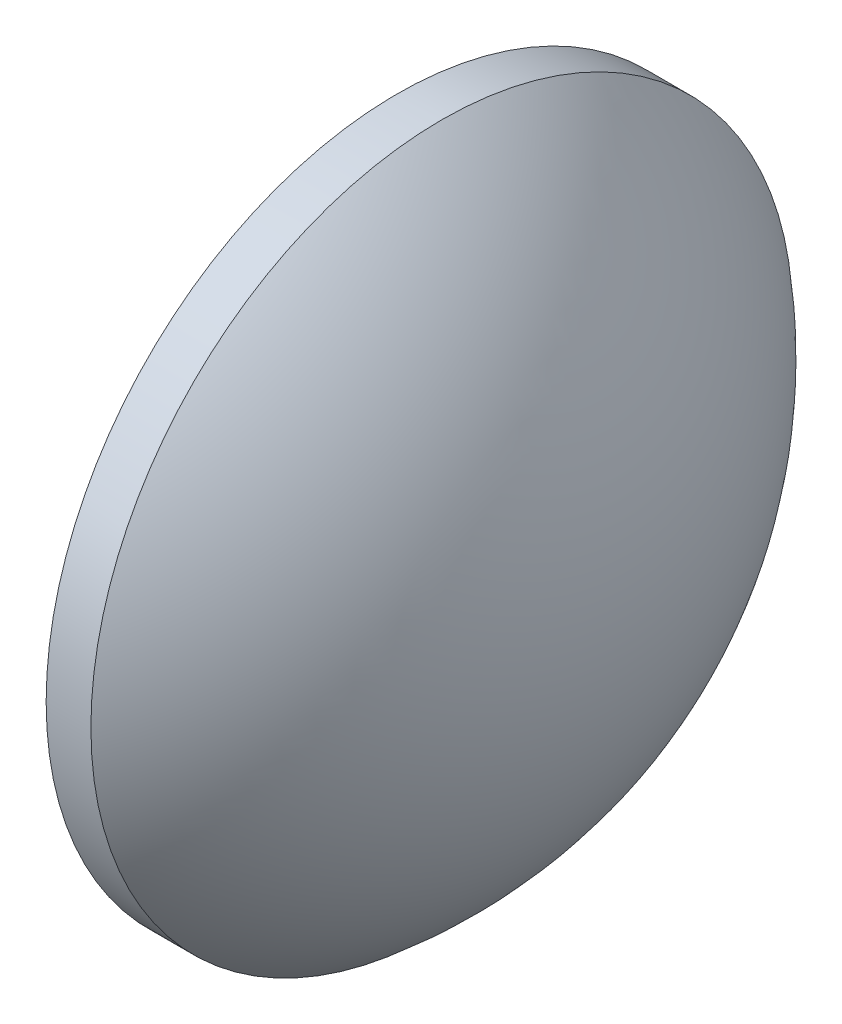
ISO-10303-21;
HEADER;
FILE_DESCRIPTION(('STEP AP214'),'2;1');
FILE_NAME('part.step','',(''),(''),'','','');
FILE_SCHEMA(('AUTOMOTIVE_DESIGN { 1 0 10303 214 1 1 1 1 }'));
ENDSEC;
DATA;
#1=APPLICATION_CONTEXT('core data for automotive mechanical design processes');
#2=APPLICATION_PROTOCOL_DEFINITION('international standard','automotive_design',2000,#1);
#3=PRODUCT_CONTEXT('',#1,'mechanical');
#4=PRODUCT('Part','Part','',(#3));
#5=PRODUCT_RELATED_PRODUCT_CATEGORY('part','',(#4));
#6=PRODUCT_DEFINITION_FORMATION('','',#4);
#7=PRODUCT_DEFINITION_CONTEXT('part definition',#1,'design');
#8=PRODUCT_DEFINITION('design','',#6,#7);
#9=PRODUCT_DEFINITION_SHAPE('','',#8);
#10=(LENGTH_UNIT() NAMED_UNIT(*) SI_UNIT(.MILLI.,.METRE.));
#11=(NAMED_UNIT(*) PLANE_ANGLE_UNIT() SI_UNIT($,.RADIAN.));
#12=(NAMED_UNIT(*) SI_UNIT($,.STERADIAN.) SOLID_ANGLE_UNIT());
#13=UNCERTAINTY_MEASURE_WITH_UNIT(LENGTH_MEASURE(1.E-05),#10,'distance_accuracy_value','');
#14=(GEOMETRIC_REPRESENTATION_CONTEXT(3) GLOBAL_UNCERTAINTY_ASSIGNED_CONTEXT((#13)) GLOBAL_UNIT_ASSIGNED_CONTEXT((#10,
#11,#12)) REPRESENTATION_CONTEXT('',''));
#15=CARTESIAN_POINT('',(0.,0.,0.));
#16=DIRECTION('',(0.,0.,1.));
#17=DIRECTION('',(1.,0.,0.));
#18=AXIS2_PLACEMENT_3D('',#15,#16,#17);
#19=CARTESIAN_POINT('',(345.222591284295,126.800050535133,0.));
#20=DIRECTION('',(-1.,0.,0.));
#21=DIRECTION('',(0.,1.,0.));
#22=AXIS2_PLACEMENT_3D('',#19,#20,#21);
#23=SPHERICAL_SURFACE('',#22,10.3556084656084);
#24=CARTESIAN_POINT('',(351.798199749904,126.800050535133,0.));
#25=DIRECTION('',(-1.,0.,0.));
#26=DIRECTION('',(0.,0.,1.));
#27=AXIS2_PLACEMENT_3D('',#24,#25,#26);
#28=CIRCLE('',#27,7.99999999999998);
#29=CARTESIAN_POINT('',(351.798199749904,126.800050535133,7.99999999999998));
#30=VERTEX_POINT('',#29);
#31=EDGE_CURVE('E10',#30,#30,#28,.T.);
#32=ORIENTED_EDGE('',*,*,#31,.F.);
#33=EDGE_LOOP('',(#32));
#34=FACE_BOUND('',#33,.T.);
#35=ADVANCED_FACE('F35',(#34),#23,.T.);
#36=CARTESIAN_POINT('',(332.151856648093,126.800050535133,0.));
#37=DIRECTION('',(-1.,0.,0.));
#38=DIRECTION('',(0.,0.,1.));
#39=AXIS2_PLACEMENT_3D('',#36,#37,#38);
#40=CYLINDRICAL_SURFACE('',#39,7.99999999999998);
#41=CARTESIAN_POINT('',(350.778199749904,126.800050535133,0.));
#42=DIRECTION('',(-1.,0.,0.));
#43=DIRECTION('',(0.,0.,1.));
#44=AXIS2_PLACEMENT_3D('',#41,#42,#43);
#45=CIRCLE('',#44,7.99999999999998);
#46=CARTESIAN_POINT('',(350.778199749904,126.800050535133,7.99999999999998));
#47=VERTEX_POINT('',#46);
#48=EDGE_CURVE('E41',#47,#47,#45,.T.);
#49=ORIENTED_EDGE('',*,*,#48,.F.);
#50=EDGE_LOOP('',(#49));
#51=FACE_BOUND('',#50,.T.);
#52=ORIENTED_EDGE('',*,*,#31,.T.);
#53=EDGE_LOOP('',(#52));
#54=FACE_BOUND('',#53,.T.);
#55=ADVANCED_FACE('F49',(#51,#54),#40,.T.);
#56=CARTESIAN_POINT('',(350.778199749904,126.800050535133,0.));
#57=DIRECTION('',(1.,0.,0.));
#58=DIRECTION('',(0.,0.,-1.));
#59=AXIS2_PLACEMENT_3D('',#56,#57,#58);
#60=PLANE('',#59);
#61=ORIENTED_EDGE('',*,*,#48,.T.);
#62=EDGE_LOOP('',(#61));
#63=FACE_BOUND('',#62,.T.);
#64=ADVANCED_FACE('F47',(#63),#60,.F.);
#65=CLOSED_SHELL('',(#35,#55,#64));
#66=MANIFOLD_SOLID_BREP('B2',#65);
#67=ADVANCED_BREP_SHAPE_REPRESENTATION('',(#18,#66),#14);
#68=SHAPE_DEFINITION_REPRESENTATION(#9,#67);
ENDSEC;
END-ISO-10303-21;
